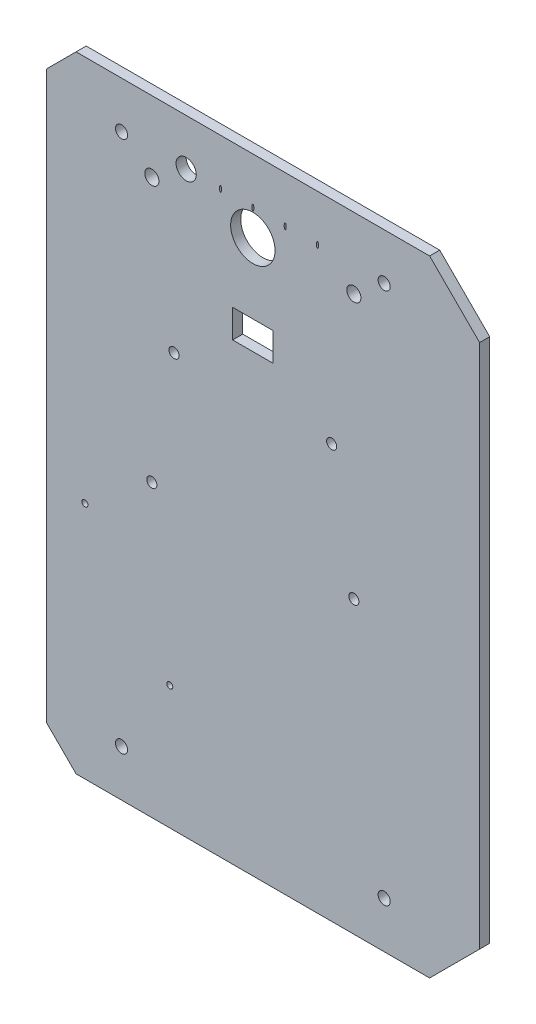
ISO-10303-21;
HEADER;
FILE_DESCRIPTION(('STEP AP214'),'2;1');
FILE_NAME('part.step','',(''),(''),'','','');
FILE_SCHEMA(('AUTOMOTIVE_DESIGN { 1 0 10303 214 1 1 1 1 }'));
ENDSEC;
DATA;
#1=APPLICATION_CONTEXT('core data for automotive mechanical design processes');
#2=APPLICATION_PROTOCOL_DEFINITION('international standard','automotive_design',2000,#1);
#3=PRODUCT_CONTEXT('',#1,'mechanical');
#4=PRODUCT('Part','Part','',(#3));
#5=PRODUCT_RELATED_PRODUCT_CATEGORY('part','',(#4));
#6=PRODUCT_DEFINITION_FORMATION('','',#4);
#7=PRODUCT_DEFINITION_CONTEXT('part definition',#1,'design');
#8=PRODUCT_DEFINITION('design','',#6,#7);
#9=PRODUCT_DEFINITION_SHAPE('','',#8);
#10=(LENGTH_UNIT() NAMED_UNIT(*) SI_UNIT(.MILLI.,.METRE.));
#11=(NAMED_UNIT(*) PLANE_ANGLE_UNIT() SI_UNIT($,.RADIAN.));
#12=(NAMED_UNIT(*) SI_UNIT($,.STERADIAN.) SOLID_ANGLE_UNIT());
#13=UNCERTAINTY_MEASURE_WITH_UNIT(LENGTH_MEASURE(1.E-05),#10,'distance_accuracy_value','');
#14=(GEOMETRIC_REPRESENTATION_CONTEXT(3) GLOBAL_UNCERTAINTY_ASSIGNED_CONTEXT((#13)) GLOBAL_UNIT_ASSIGNED_CONTEXT((#10,
#11,#12)) REPRESENTATION_CONTEXT('',''));
#15=CARTESIAN_POINT('',(0.,0.,0.));
#16=DIRECTION('',(0.,0.,1.));
#17=DIRECTION('',(1.,0.,0.));
#18=AXIS2_PLACEMENT_3D('',#15,#16,#17);
#19=CARTESIAN_POINT('',(24.7487373415291,24.7487373415292,5.));
#20=DIRECTION('',(-0.707106781186548,0.707106781186547,0.));
#21=DIRECTION('',(-0.707106781186547,-0.707106781186548,0.));
#22=AXIS2_PLACEMENT_3D('',#19,#20,#21);
#23=PLANE('',#22);
#24=DIRECTION('',(0.707106781186547,0.707106781186548,0.));
#25=VECTOR('',#24,1.);
#26=CARTESIAN_POINT('',(24.7487373415291,24.7487373415292,0.));
#27=LINE('',#26,#25);
#28=CARTESIAN_POINT('',(0.,0.,0.));
#29=VERTEX_POINT('',#28);
#30=CARTESIAN_POINT('',(24.7487373415291,24.7487373415292,0.));
#31=VERTEX_POINT('',#30);
#32=EDGE_CURVE('E148',#29,#31,#27,.T.);
#33=ORIENTED_EDGE('',*,*,#32,.T.);
#34=DIRECTION('',(0.,0.,-1.));
#35=VECTOR('',#34,1.);
#36=CARTESIAN_POINT('',(24.7487373415291,24.7487373415292,5.));
#37=LINE('',#36,#35);
#38=CARTESIAN_POINT('',(24.7487373415291,24.7487373415292,5.));
#39=VERTEX_POINT('',#38);
#40=EDGE_CURVE('E178',#39,#31,#37,.T.);
#41=ORIENTED_EDGE('',*,*,#40,.F.);
#42=DIRECTION('',(0.707106781186547,0.707106781186548,0.));
#43=VECTOR('',#42,1.);
#44=CARTESIAN_POINT('',(24.7487373415291,24.7487373415292,5.));
#45=LINE('',#44,#43);
#46=CARTESIAN_POINT('',(0.,0.,5.));
#47=VERTEX_POINT('',#46);
#48=EDGE_CURVE('E165',#47,#39,#45,.T.);
#49=ORIENTED_EDGE('',*,*,#48,.F.);
#50=DIRECTION('',(0.,0.,-1.));
#51=VECTOR('',#50,1.);
#52=CARTESIAN_POINT('',(0.,0.,5.));
#53=LINE('',#52,#51);
#54=EDGE_CURVE('E142',#47,#29,#53,.T.);
#55=ORIENTED_EDGE('',*,*,#54,.T.);
#56=EDGE_LOOP('',(#33,#41,#49,#55));
#57=FACE_BOUND('',#56,.T.);
#58=ADVANCED_FACE('F32',(#57),#23,.F.);
#59=CARTESIAN_POINT('',(24.7487373415292,284.748737341529,5.));
#60=DIRECTION('',(-1.,0.,0.));
#61=DIRECTION('',(0.,-1.,0.));
#62=AXIS2_PLACEMENT_3D('',#59,#60,#61);
#63=PLANE('',#62);
#64=DIRECTION('',(0.,1.,0.));
#65=VECTOR('',#64,1.);
#66=CARTESIAN_POINT('',(24.7487373415292,284.748737341529,0.));
#67=LINE('',#66,#65);
#68=CARTESIAN_POINT('',(24.7487373415292,284.748737341529,0.));
#69=VERTEX_POINT('',#68);
#70=EDGE_CURVE('E151',#31,#69,#67,.T.);
#71=ORIENTED_EDGE('',*,*,#70,.T.);
#72=DIRECTION('',(0.,0.,-1.));
#73=VECTOR('',#72,1.);
#74=CARTESIAN_POINT('',(24.7487373415292,284.748737341529,5.));
#75=LINE('',#74,#73);
#76=CARTESIAN_POINT('',(24.7487373415292,284.748737341529,5.));
#77=VERTEX_POINT('',#76);
#78=EDGE_CURVE('E175',#77,#69,#75,.T.);
#79=ORIENTED_EDGE('',*,*,#78,.F.);
#80=DIRECTION('',(0.,1.,0.));
#81=VECTOR('',#80,1.);
#82=CARTESIAN_POINT('',(24.7487373415292,284.748737341529,5.));
#83=LINE('',#82,#81);
#84=EDGE_CURVE('E409',#39,#77,#83,.T.);
#85=ORIENTED_EDGE('',*,*,#84,.F.);
#86=ORIENTED_EDGE('',*,*,#40,.T.);
#87=EDGE_LOOP('',(#71,#79,#85,#86));
#88=FACE_BOUND('',#87,.T.);
#89=ADVANCED_FACE('F290',(#88),#63,.F.);
#90=CARTESIAN_POINT('',(0.,309.497474683058,5.));
#91=DIRECTION('',(-0.707106781186547,-0.707106781186548,0.));
#92=DIRECTION('',(0.707106781186548,-0.707106781186547,0.));
#93=AXIS2_PLACEMENT_3D('',#90,#91,#92);
#94=PLANE('',#93);
#95=DIRECTION('',(-0.707106781186548,0.707106781186547,0.));
#96=VECTOR('',#95,1.);
#97=CARTESIAN_POINT('',(0.,309.497474683058,0.));
#98=LINE('',#97,#96);
#99=CARTESIAN_POINT('',(0.,309.497474683058,0.));
#100=VERTEX_POINT('',#99);
#101=EDGE_CURVE('E154',#69,#100,#98,.T.);
#102=ORIENTED_EDGE('',*,*,#101,.T.);
#103=DIRECTION('',(0.,0.,-1.));
#104=VECTOR('',#103,1.);
#105=CARTESIAN_POINT('',(0.,309.497474683058,5.));
#106=LINE('',#105,#104);
#107=CARTESIAN_POINT('',(0.,309.497474683058,5.));
#108=VERTEX_POINT('',#107);
#109=EDGE_CURVE('E172',#108,#100,#106,.T.);
#110=ORIENTED_EDGE('',*,*,#109,.F.);
#111=DIRECTION('',(-0.707106781186548,0.707106781186547,0.));
#112=VECTOR('',#111,1.);
#113=CARTESIAN_POINT('',(0.,309.497474683058,5.));
#114=LINE('',#113,#112);
#115=EDGE_CURVE('E305',#77,#108,#114,.T.);
#116=ORIENTED_EDGE('',*,*,#115,.F.);
#117=ORIENTED_EDGE('',*,*,#78,.T.);
#118=EDGE_LOOP('',(#102,#110,#116,#117));
#119=FACE_BOUND('',#118,.T.);
#120=ADVANCED_FACE('F287',(#119),#94,.F.);
#121=CARTESIAN_POINT('',(-175.,309.497474683058,5.));
#122=DIRECTION('',(0.,-1.,0.));
#123=DIRECTION('',(0.,0.,-1.));
#124=AXIS2_PLACEMENT_3D('',#121,#122,#123);
#125=PLANE('',#124);
#126=DIRECTION('',(-1.,0.,0.));
#127=VECTOR('',#126,1.);
#128=CARTESIAN_POINT('',(-175.,309.497474683058,0.));
#129=LINE('',#128,#127);
#130=CARTESIAN_POINT('',(-175.,309.497474683058,0.));
#131=VERTEX_POINT('',#130);
#132=EDGE_CURVE('E156',#100,#131,#129,.T.);
#133=ORIENTED_EDGE('',*,*,#132,.T.);
#134=DIRECTION('',(0.,0.,-1.));
#135=VECTOR('',#134,1.);
#136=CARTESIAN_POINT('',(-175.,309.497474683058,5.));
#137=LINE('',#136,#135);
#138=CARTESIAN_POINT('',(-175.,309.497474683058,5.));
#139=VERTEX_POINT('',#138);
#140=EDGE_CURVE('E169',#139,#131,#137,.T.);
#141=ORIENTED_EDGE('',*,*,#140,.F.);
#142=DIRECTION('',(-1.,0.,0.));
#143=VECTOR('',#142,1.);
#144=CARTESIAN_POINT('',(-175.,309.497474683058,5.));
#145=LINE('',#144,#143);
#146=EDGE_CURVE('E144',#108,#139,#145,.T.);
#147=ORIENTED_EDGE('',*,*,#146,.F.);
#148=ORIENTED_EDGE('',*,*,#109,.T.);
#149=EDGE_LOOP('',(#133,#141,#147,#148));
#150=FACE_BOUND('',#149,.T.);
#151=ADVANCED_FACE('F283',(#150),#125,.F.);
#152=CARTESIAN_POINT('',(-199.748737341529,284.748737341529,5.));
#153=DIRECTION('',(0.707106781186548,-0.707106781186548,0.));
#154=DIRECTION('',(0.707106781186548,0.707106781186548,0.));
#155=AXIS2_PLACEMENT_3D('',#152,#153,#154);
#156=PLANE('',#155);
#157=DIRECTION('',(-0.707106781186547,-0.707106781186547,0.));
#158=VECTOR('',#157,1.);
#159=CARTESIAN_POINT('',(-199.748737341529,284.748737341529,0.));
#160=LINE('',#159,#158);
#161=CARTESIAN_POINT('',(-189.748737341529,294.748737341529,0.));
#162=VERTEX_POINT('',#161);
#163=EDGE_CURVE('E158',#131,#162,#160,.T.);
#164=ORIENTED_EDGE('',*,*,#163,.T.);
#165=DIRECTION('',(0.,0.,1.));
#166=VECTOR('',#165,1.);
#167=CARTESIAN_POINT('',(-189.748737341529,294.748737341529,5.));
#168=LINE('',#167,#166);
#169=CARTESIAN_POINT('',(-189.748737341529,294.748737341529,5.));
#170=VERTEX_POINT('',#169);
#171=EDGE_CURVE('E45',#162,#170,#168,.T.);
#172=ORIENTED_EDGE('',*,*,#171,.T.);
#173=DIRECTION('',(-0.707106781186547,-0.707106781186547,0.));
#174=VECTOR('',#173,1.);
#175=CARTESIAN_POINT('',(-199.748737341529,284.748737341529,5.));
#176=LINE('',#175,#174);
#177=EDGE_CURVE('E133',#139,#170,#176,.T.);
#178=ORIENTED_EDGE('',*,*,#177,.F.);
#179=ORIENTED_EDGE('',*,*,#140,.T.);
#180=EDGE_LOOP('',(#164,#172,#178,#179));
#181=FACE_BOUND('',#180,.T.);
#182=ADVANCED_FACE('F280',(#181),#156,.F.);
#183=CARTESIAN_POINT('',(-175.,0.,5.));
#184=DIRECTION('',(0.707106781186547,0.707106781186548,0.));
#185=DIRECTION('',(-0.707106781186548,0.707106781186547,0.));
#186=AXIS2_PLACEMENT_3D('',#183,#184,#185);
#187=PLANE('',#186);
#188=DIRECTION('',(0.707106781186548,-0.707106781186547,0.));
#189=VECTOR('',#188,1.);
#190=CARTESIAN_POINT('',(-175.,0.,5.));
#191=LINE('',#190,#189);
#192=CARTESIAN_POINT('',(-189.748737341529,14.7487373415291,5.));
#193=VERTEX_POINT('',#192);
#194=CARTESIAN_POINT('',(-175.,0.,5.));
#195=VERTEX_POINT('',#194);
#196=EDGE_CURVE('E130',#193,#195,#191,.T.);
#197=ORIENTED_EDGE('',*,*,#196,.F.);
#198=DIRECTION('',(0.,0.,-1.));
#199=VECTOR('',#198,1.);
#200=CARTESIAN_POINT('',(-189.748737341529,14.7487373415291,5.));
#201=LINE('',#200,#199);
#202=CARTESIAN_POINT('',(-189.748737341529,14.7487373415291,0.));
#203=VERTEX_POINT('',#202);
#204=EDGE_CURVE('E118',#193,#203,#201,.T.);
#205=ORIENTED_EDGE('',*,*,#204,.T.);
#206=DIRECTION('',(0.707106781186548,-0.707106781186547,0.));
#207=VECTOR('',#206,1.);
#208=CARTESIAN_POINT('',(-175.,0.,0.));
#209=LINE('',#208,#207);
#210=CARTESIAN_POINT('',(-175.,0.,0.));
#211=VERTEX_POINT('',#210);
#212=EDGE_CURVE('E161',#203,#211,#209,.T.);
#213=ORIENTED_EDGE('',*,*,#212,.T.);
#214=DIRECTION('',(0.,0.,-1.));
#215=VECTOR('',#214,1.);
#216=CARTESIAN_POINT('',(-175.,0.,5.));
#217=LINE('',#216,#215);
#218=EDGE_CURVE('E138',#195,#211,#217,.T.);
#219=ORIENTED_EDGE('',*,*,#218,.F.);
#220=EDGE_LOOP('',(#197,#205,#213,#219));
#221=FACE_BOUND('',#220,.T.);
#222=ADVANCED_FACE('F136',(#221),#187,.F.);
#223=CARTESIAN_POINT('',(0.,0.,5.));
#224=DIRECTION('',(0.,1.,0.));
#225=DIRECTION('',(0.,0.,1.));
#226=AXIS2_PLACEMENT_3D('',#223,#224,#225);
#227=PLANE('',#226);
#228=DIRECTION('',(1.,0.,0.));
#229=VECTOR('',#228,1.);
#230=CARTESIAN_POINT('',(0.,0.,0.));
#231=LINE('',#230,#229);
#232=EDGE_CURVE('E163',#211,#29,#231,.T.);
#233=ORIENTED_EDGE('',*,*,#232,.T.);
#234=ORIENTED_EDGE('',*,*,#54,.F.);
#235=DIRECTION('',(1.,0.,0.));
#236=VECTOR('',#235,1.);
#237=CARTESIAN_POINT('',(0.,0.,5.));
#238=LINE('',#237,#236);
#239=EDGE_CURVE('E140',#195,#47,#238,.T.);
#240=ORIENTED_EDGE('',*,*,#239,.F.);
#241=ORIENTED_EDGE('',*,*,#218,.T.);
#242=EDGE_LOOP('',(#233,#234,#240,#241));
#243=FACE_BOUND('',#242,.T.);
#244=ADVANCED_FACE('F270',(#243),#227,.F.);
#245=CARTESIAN_POINT('',(0.,0.,5.));
#246=DIRECTION('',(0.,0.,-1.));
#247=DIRECTION('',(-1.,0.,0.));
#248=AXIS2_PLACEMENT_3D('',#245,#246,#247);
#249=PLANE('',#248);
#250=CARTESIAN_POINT('',(-128.614939474584,61.1523718393633,5.));
#251=DIRECTION('',(0.,0.,1.));
#252=DIRECTION('',(1.,0.,0.));
#253=AXIS2_PLACEMENT_3D('',#250,#251,#252);
#254=CIRCLE('',#253,1.49999999999997);
#255=CARTESIAN_POINT('',(-127.114939474584,61.1523718393633,5.));
#256=VERTEX_POINT('',#255);
#257=EDGE_CURVE('E507',#256,#256,#254,.T.);
#258=ORIENTED_EDGE('',*,*,#257,.F.);
#259=EDGE_LOOP('',(#258));
#260=FACE_BOUND('',#259,.T.);
#261=CARTESIAN_POINT('',(-170.614939474584,118.152371839363,5.));
#262=DIRECTION('',(0.,0.,1.));
#263=DIRECTION('',(1.,0.,0.));
#264=AXIS2_PLACEMENT_3D('',#261,#262,#263);
#265=CIRCLE('',#264,1.5);
#266=CARTESIAN_POINT('',(-169.114939474584,118.152371839363,5.));
#267=VERTEX_POINT('',#266);
#268=EDGE_CURVE('E134',#267,#267,#265,.T.);
#269=ORIENTED_EDGE('',*,*,#268,.F.);
#270=EDGE_LOOP('',(#269));
#271=FACE_BOUND('',#270,.T.);
#272=CARTESIAN_POINT('',(-137.5,143.748737341529,5.));
#273=DIRECTION('',(0.,0.,1.));
#274=DIRECTION('',(1.,0.,0.));
#275=AXIS2_PLACEMENT_3D('',#272,#273,#274);
#276=CIRCLE('',#275,2.5);
#277=CARTESIAN_POINT('',(-135.,143.748737341529,5.));
#278=VERTEX_POINT('',#277);
#279=EDGE_CURVE('E320',#278,#278,#276,.T.);
#280=ORIENTED_EDGE('',*,*,#279,.F.);
#281=EDGE_LOOP('',(#280));
#282=FACE_BOUND('',#281,.T.);
#283=CARTESIAN_POINT('',(-22.5012626584709,286.497474683058,5.));
#284=DIRECTION('',(0.,0.,1.));
#285=DIRECTION('',(1.,0.,0.));
#286=AXIS2_PLACEMENT_3D('',#283,#284,#285);
#287=CIRCLE('',#286,3.00000000000001);
#288=CARTESIAN_POINT('',(-19.5012626584709,286.497474683058,5.));
#289=VERTEX_POINT('',#288);
#290=EDGE_CURVE('E323',#289,#289,#287,.T.);
#291=ORIENTED_EDGE('',*,*,#290,.F.);
#292=EDGE_LOOP('',(#291));
#293=FACE_BOUND('',#292,.T.);
#294=CARTESIAN_POINT('',(-22.5012626584708,23.,5.));
#295=DIRECTION('',(0.,0.,1.));
#296=DIRECTION('',(-1.,0.,0.));
#297=AXIS2_PLACEMENT_3D('',#294,#295,#296);
#298=CIRCLE('',#297,2.99999999999999);
#299=CARTESIAN_POINT('',(-25.5012626584708,23.,5.));
#300=VERTEX_POINT('',#299);
#301=EDGE_CURVE('E326',#300,#300,#298,.T.);
#302=ORIENTED_EDGE('',*,*,#301,.F.);
#303=EDGE_LOOP('',(#302));
#304=FACE_BOUND('',#303,.T.);
#305=CARTESIAN_POINT('',(-152.498737341529,286.497474683058,5.));
#306=DIRECTION('',(0.,0.,1.));
#307=DIRECTION('',(-1.,0.,0.));
#308=AXIS2_PLACEMENT_3D('',#305,#306,#307);
#309=CIRCLE('',#308,2.99999999999999);
#310=CARTESIAN_POINT('',(-155.498737341529,286.497474683058,5.));
#311=VERTEX_POINT('',#310);
#312=EDGE_CURVE('E329',#311,#311,#309,.T.);
#313=ORIENTED_EDGE('',*,*,#312,.F.);
#314=EDGE_LOOP('',(#313));
#315=FACE_BOUND('',#314,.T.);
#316=CARTESIAN_POINT('',(-48.5,204.748737341529,5.));
#317=DIRECTION('',(0.,0.,1.));
#318=DIRECTION('',(-1.,0.,0.));
#319=AXIS2_PLACEMENT_3D('',#316,#317,#318);
#320=CIRCLE('',#319,2.5);
#321=CARTESIAN_POINT('',(-51.,204.748737341529,5.));
#322=VERTEX_POINT('',#321);
#323=EDGE_CURVE('E311',#322,#322,#320,.T.);
#324=ORIENTED_EDGE('',*,*,#323,.F.);
#325=EDGE_LOOP('',(#324));
#326=FACE_BOUND('',#325,.T.);
#327=CARTESIAN_POINT('',(-37.5,143.748737341529,5.));
#328=DIRECTION('',(0.,0.,1.));
#329=DIRECTION('',(-1.,0.,0.));
#330=AXIS2_PLACEMENT_3D('',#327,#328,#329);
#331=CIRCLE('',#330,2.5);
#332=CARTESIAN_POINT('',(-40.,143.748737341529,5.));
#333=VERTEX_POINT('',#332);
#334=EDGE_CURVE('E314',#333,#333,#331,.T.);
#335=ORIENTED_EDGE('',*,*,#334,.F.);
#336=EDGE_LOOP('',(#335));
#337=FACE_BOUND('',#336,.T.);
#338=CARTESIAN_POINT('',(-126.5,204.748737341529,5.));
#339=DIRECTION('',(0.,0.,1.));
#340=DIRECTION('',(1.,0.,0.));
#341=AXIS2_PLACEMENT_3D('',#338,#339,#340);
#342=CIRCLE('',#341,2.5);
#343=CARTESIAN_POINT('',(-124.,204.748737341529,5.));
#344=VERTEX_POINT('',#343);
#345=EDGE_CURVE('E317',#344,#344,#342,.T.);
#346=ORIENTED_EDGE('',*,*,#345,.F.);
#347=EDGE_LOOP('',(#346));
#348=FACE_BOUND('',#347,.T.);
#349=CARTESIAN_POINT('',(-152.498737341529,23.,5.));
#350=DIRECTION('',(0.,0.,1.));
#351=DIRECTION('',(1.,0.,0.));
#352=AXIS2_PLACEMENT_3D('',#349,#350,#351);
#353=CIRCLE('',#352,2.99999999999999);
#354=CARTESIAN_POINT('',(-149.498737341529,23.,5.));
#355=VERTEX_POINT('',#354);
#356=EDGE_CURVE('E218',#355,#355,#353,.T.);
#357=ORIENTED_EDGE('',*,*,#356,.F.);
#358=EDGE_LOOP('',(#357));
#359=FACE_BOUND('',#358,.T.);
#360=CARTESIAN_POINT('',(-55.5,286.497474683058,5.));
#361=DIRECTION('',(0.,0.,1.));
#362=DIRECTION('',(0.,-1.,0.));
#363=AXIS2_PLACEMENT_3D('',#360,#361,#362);
#364=ELLIPSE('',#363,1.5,0.5);
#365=CARTESIAN_POINT('',(-55.5,284.997474683058,5.));
#366=VERTEX_POINT('',#365);
#367=EDGE_CURVE('E237',#366,#366,#364,.T.);
#368=ORIENTED_EDGE('',*,*,#367,.F.);
#369=EDGE_LOOP('',(#368));
#370=FACE_BOUND('',#369,.T.);
#371=CARTESIAN_POINT('',(-71.5,286.497474683058,5.));
#372=DIRECTION('',(0.,0.,1.));
#373=DIRECTION('',(0.,-1.,0.));
#374=AXIS2_PLACEMENT_3D('',#371,#372,#373);
#375=ELLIPSE('',#374,1.5,0.5);
#376=CARTESIAN_POINT('',(-71.5,284.997474683058,5.));
#377=VERTEX_POINT('',#376);
#378=EDGE_CURVE('E241',#377,#377,#375,.T.);
#379=ORIENTED_EDGE('',*,*,#378,.F.);
#380=EDGE_LOOP('',(#379));
#381=FACE_BOUND('',#380,.T.);
#382=CARTESIAN_POINT('',(-87.5,286.497474683058,5.));
#383=DIRECTION('',(0.,0.,1.));
#384=DIRECTION('',(0.,-1.,0.));
#385=AXIS2_PLACEMENT_3D('',#382,#383,#384);
#386=ELLIPSE('',#385,1.5,0.5);
#387=CARTESIAN_POINT('',(-87.5,284.997474683058,5.));
#388=VERTEX_POINT('',#387);
#389=EDGE_CURVE('E246',#388,#388,#386,.T.);
#390=ORIENTED_EDGE('',*,*,#389,.F.);
#391=EDGE_LOOP('',(#390));
#392=FACE_BOUND('',#391,.T.);
#393=CARTESIAN_POINT('',(-87.5,273.497474683058,5.));
#394=DIRECTION('',(0.,0.,1.));
#395=DIRECTION('',(1.,0.,0.));
#396=AXIS2_PLACEMENT_3D('',#393,#394,#395);
#397=CIRCLE('',#396,11.);
#398=CARTESIAN_POINT('',(-76.5,273.497474683058,5.));
#399=VERTEX_POINT('',#398);
#400=EDGE_CURVE('E358',#399,#399,#397,.T.);
#401=ORIENTED_EDGE('',*,*,#400,.F.);
#402=EDGE_LOOP('',(#401));
#403=FACE_BOUND('',#402,.T.);
#404=CARTESIAN_POINT('',(-37.5,274.497474683058,5.));
#405=DIRECTION('',(0.,0.,1.));
#406=DIRECTION('',(1.,0.,0.));
#407=AXIS2_PLACEMENT_3D('',#404,#405,#406);
#408=CIRCLE('',#407,3.50000000000001);
#409=CARTESIAN_POINT('',(-34.,274.497474683058,5.));
#410=VERTEX_POINT('',#409);
#411=EDGE_CURVE('E339',#410,#410,#408,.T.);
#412=ORIENTED_EDGE('',*,*,#411,.F.);
#413=EDGE_LOOP('',(#412));
#414=FACE_BOUND('',#413,.T.);
#415=CARTESIAN_POINT('',(-137.5,274.497474683058,5.));
#416=DIRECTION('',(0.,0.,1.));
#417=DIRECTION('',(1.,0.,0.));
#418=AXIS2_PLACEMENT_3D('',#415,#416,#417);
#419=CIRCLE('',#418,3.50000000000002);
#420=CARTESIAN_POINT('',(-134.,274.497474683058,5.));
#421=VERTEX_POINT('',#420);
#422=EDGE_CURVE('E336',#421,#421,#419,.T.);
#423=ORIENTED_EDGE('',*,*,#422,.F.);
#424=EDGE_LOOP('',(#423));
#425=FACE_BOUND('',#424,.T.);
#426=DIRECTION('',(1.,0.,0.));
#427=VECTOR('',#426,1.);
#428=CARTESIAN_POINT('',(-97.5,224.748737341529,5.));
#429=LINE('',#428,#427);
#430=CARTESIAN_POINT('',(-97.5,224.748737341529,5.));
#431=VERTEX_POINT('',#430);
#432=CARTESIAN_POINT('',(-77.5,224.748737341529,5.));
#433=VERTEX_POINT('',#432);
#434=EDGE_CURVE('E342',#431,#433,#429,.T.);
#435=ORIENTED_EDGE('',*,*,#434,.F.);
#436=DIRECTION('',(0.,-1.,0.));
#437=VECTOR('',#436,1.);
#438=CARTESIAN_POINT('',(-97.5,238.748737341529,5.));
#439=LINE('',#438,#437);
#440=CARTESIAN_POINT('',(-97.5,238.748737341529,5.));
#441=VERTEX_POINT('',#440);
#442=EDGE_CURVE('E53',#441,#431,#439,.T.);
#443=ORIENTED_EDGE('',*,*,#442,.F.);
#444=DIRECTION('',(-1.,0.,0.));
#445=VECTOR('',#444,1.);
#446=CARTESIAN_POINT('',(-97.5,238.748737341529,5.));
#447=LINE('',#446,#445);
#448=CARTESIAN_POINT('',(-77.5,238.748737341529,5.));
#449=VERTEX_POINT('',#448);
#450=EDGE_CURVE('E348',#449,#441,#447,.T.);
#451=ORIENTED_EDGE('',*,*,#450,.F.);
#452=DIRECTION('',(0.,1.,0.));
#453=VECTOR('',#452,1.);
#454=CARTESIAN_POINT('',(-77.5,238.748737341529,5.));
#455=LINE('',#454,#453);
#456=EDGE_CURVE('E345',#433,#449,#455,.T.);
#457=ORIENTED_EDGE('',*,*,#456,.F.);
#458=EDGE_LOOP('',(#435,#443,#451,#457));
#459=FACE_BOUND('',#458,.T.);
#460=CARTESIAN_POINT('',(-103.5,286.497474683058,5.));
#461=DIRECTION('',(0.,0.,1.));
#462=DIRECTION('',(0.,-1.,0.));
#463=AXIS2_PLACEMENT_3D('',#460,#461,#462);
#464=ELLIPSE('',#463,1.5,0.5);
#465=CARTESIAN_POINT('',(-103.5,284.997474683058,5.));
#466=VERTEX_POINT('',#465);
#467=EDGE_CURVE('E189',#466,#466,#464,.T.);
#468=ORIENTED_EDGE('',*,*,#467,.F.);
#469=EDGE_LOOP('',(#468));
#470=FACE_BOUND('',#469,.T.);
#471=CARTESIAN_POINT('',(-120.5,286.497474683058,5.));
#472=DIRECTION('',(0.,0.,1.));
#473=DIRECTION('',(1.,0.,0.));
#474=AXIS2_PLACEMENT_3D('',#471,#472,#473);
#475=CIRCLE('',#474,5.00000000000001);
#476=CARTESIAN_POINT('',(-115.5,286.497474683058,5.));
#477=VERTEX_POINT('',#476);
#478=EDGE_CURVE('E184',#477,#477,#475,.T.);
#479=ORIENTED_EDGE('',*,*,#478,.F.);
#480=EDGE_LOOP('',(#479));
#481=FACE_BOUND('',#480,.T.);
#482=ORIENTED_EDGE('',*,*,#177,.T.);
#483=DIRECTION('',(0.,1.,0.));
#484=VECTOR('',#483,1.);
#485=CARTESIAN_POINT('',(-189.748737341529,134.748737341529,5.));
#486=LINE('',#485,#484);
#487=EDGE_CURVE('E121',#193,#170,#486,.T.);
#488=ORIENTED_EDGE('',*,*,#487,.F.);
#489=ORIENTED_EDGE('',*,*,#196,.T.);
#490=ORIENTED_EDGE('',*,*,#239,.T.);
#491=ORIENTED_EDGE('',*,*,#48,.T.);
#492=ORIENTED_EDGE('',*,*,#84,.T.);
#493=ORIENTED_EDGE('',*,*,#115,.T.);
#494=ORIENTED_EDGE('',*,*,#146,.T.);
#495=EDGE_LOOP('',(#482,#488,#489,#490,#491,#492,#493,#494));
#496=FACE_BOUND('',#495,.T.);
#497=ADVANCED_FACE('F129',(#260,#271,#282,#293,#304,#315,#326,#337,#348,#359,#370,#381,#392,
#403,#414,#425,#459,#470,#481,#496),#249,.F.);
#498=CARTESIAN_POINT('',(0.,0.,0.));
#499=DIRECTION('',(0.,0.,-1.));
#500=DIRECTION('',(-1.,0.,0.));
#501=AXIS2_PLACEMENT_3D('',#498,#499,#500);
#502=PLANE('',#501);
#503=CARTESIAN_POINT('',(-128.614939474584,61.1523718393633,0.));
#504=DIRECTION('',(0.,0.,1.));
#505=DIRECTION('',(1.,0.,0.));
#506=AXIS2_PLACEMENT_3D('',#503,#504,#505);
#507=CIRCLE('',#506,1.49999999999997);
#508=CARTESIAN_POINT('',(-127.114939474584,61.1523718393633,0.));
#509=VERTEX_POINT('',#508);
#510=EDGE_CURVE('E125',#509,#509,#507,.T.);
#511=ORIENTED_EDGE('',*,*,#510,.T.);
#512=EDGE_LOOP('',(#511));
#513=FACE_BOUND('',#512,.T.);
#514=CARTESIAN_POINT('',(-170.614939474584,118.152371839363,0.));
#515=DIRECTION('',(0.,0.,1.));
#516=DIRECTION('',(1.,0.,0.));
#517=AXIS2_PLACEMENT_3D('',#514,#515,#516);
#518=CIRCLE('',#517,1.5);
#519=CARTESIAN_POINT('',(-169.114939474584,118.152371839363,0.));
#520=VERTEX_POINT('',#519);
#521=EDGE_CURVE('E508',#520,#520,#518,.T.);
#522=ORIENTED_EDGE('',*,*,#521,.T.);
#523=EDGE_LOOP('',(#522));
#524=FACE_BOUND('',#523,.T.);
#525=DIRECTION('',(0.,-1.,0.));
#526=VECTOR('',#525,1.);
#527=CARTESIAN_POINT('',(-189.748737341529,0.,0.));
#528=LINE('',#527,#526);
#529=EDGE_CURVE('E11',#162,#203,#528,.T.);
#530=ORIENTED_EDGE('',*,*,#529,.F.);
#531=ORIENTED_EDGE('',*,*,#163,.F.);
#532=ORIENTED_EDGE('',*,*,#132,.F.);
#533=ORIENTED_EDGE('',*,*,#101,.F.);
#534=ORIENTED_EDGE('',*,*,#70,.F.);
#535=ORIENTED_EDGE('',*,*,#32,.F.);
#536=ORIENTED_EDGE('',*,*,#232,.F.);
#537=ORIENTED_EDGE('',*,*,#212,.F.);
#538=EDGE_LOOP('',(#530,#531,#532,#533,#534,#535,#536,#537));
#539=FACE_BOUND('',#538,.T.);
#540=CARTESIAN_POINT('',(-137.5,143.748737341529,0.));
#541=DIRECTION('',(0.,0.,-1.));
#542=DIRECTION('',(-1.,0.,0.));
#543=AXIS2_PLACEMENT_3D('',#540,#541,#542);
#544=CIRCLE('',#543,2.5);
#545=CARTESIAN_POINT('',(-140.,143.748737341529,0.));
#546=VERTEX_POINT('',#545);
#547=EDGE_CURVE('E235',#546,#546,#544,.T.);
#548=ORIENTED_EDGE('',*,*,#547,.F.);
#549=EDGE_LOOP('',(#548));
#550=FACE_BOUND('',#549,.T.);
#551=CARTESIAN_POINT('',(-22.5012626584709,286.497474683058,0.));
#552=DIRECTION('',(0.,0.,-1.));
#553=DIRECTION('',(-1.,0.,0.));
#554=AXIS2_PLACEMENT_3D('',#551,#552,#553);
#555=CIRCLE('',#554,3.00000000000001);
#556=CARTESIAN_POINT('',(-25.5012626584709,286.497474683058,0.));
#557=VERTEX_POINT('',#556);
#558=EDGE_CURVE('E233',#557,#557,#555,.T.);
#559=ORIENTED_EDGE('',*,*,#558,.F.);
#560=EDGE_LOOP('',(#559));
#561=FACE_BOUND('',#560,.T.);
#562=CARTESIAN_POINT('',(-22.5012626584708,23.,0.));
#563=DIRECTION('',(0.,0.,-1.));
#564=DIRECTION('',(-1.,0.,0.));
#565=AXIS2_PLACEMENT_3D('',#562,#563,#564);
#566=CIRCLE('',#565,2.99999999999999);
#567=CARTESIAN_POINT('',(-25.5012626584708,23.,0.));
#568=VERTEX_POINT('',#567);
#569=EDGE_CURVE('E230',#568,#568,#566,.T.);
#570=ORIENTED_EDGE('',*,*,#569,.F.);
#571=EDGE_LOOP('',(#570));
#572=FACE_BOUND('',#571,.T.);
#573=CARTESIAN_POINT('',(-152.498737341529,286.497474683058,0.));
#574=DIRECTION('',(0.,0.,-1.));
#575=DIRECTION('',(-1.,0.,0.));
#576=AXIS2_PLACEMENT_3D('',#573,#574,#575);
#577=CIRCLE('',#576,2.99999999999999);
#578=CARTESIAN_POINT('',(-155.498737341529,286.497474683058,0.));
#579=VERTEX_POINT('',#578);
#580=EDGE_CURVE('E227',#579,#579,#577,.T.);
#581=ORIENTED_EDGE('',*,*,#580,.F.);
#582=EDGE_LOOP('',(#581));
#583=FACE_BOUND('',#582,.T.);
#584=CARTESIAN_POINT('',(-48.5,204.748737341529,0.));
#585=DIRECTION('',(0.,0.,-1.));
#586=DIRECTION('',(-1.,0.,0.));
#587=AXIS2_PLACEMENT_3D('',#584,#585,#586);
#588=CIRCLE('',#587,2.5);
#589=CARTESIAN_POINT('',(-51.,204.748737341529,0.));
#590=VERTEX_POINT('',#589);
#591=EDGE_CURVE('E224',#590,#590,#588,.T.);
#592=ORIENTED_EDGE('',*,*,#591,.F.);
#593=EDGE_LOOP('',(#592));
#594=FACE_BOUND('',#593,.T.);
#595=CARTESIAN_POINT('',(-37.5,143.748737341529,0.));
#596=DIRECTION('',(0.,0.,-1.));
#597=DIRECTION('',(-1.,0.,0.));
#598=AXIS2_PLACEMENT_3D('',#595,#596,#597);
#599=CIRCLE('',#598,2.5);
#600=CARTESIAN_POINT('',(-40.,143.748737341529,0.));
#601=VERTEX_POINT('',#600);
#602=EDGE_CURVE('E221',#601,#601,#599,.T.);
#603=ORIENTED_EDGE('',*,*,#602,.F.);
#604=EDGE_LOOP('',(#603));
#605=FACE_BOUND('',#604,.T.);
#606=CARTESIAN_POINT('',(-126.5,204.748737341529,0.));
#607=DIRECTION('',(0.,0.,-1.));
#608=DIRECTION('',(-1.,0.,0.));
#609=AXIS2_PLACEMENT_3D('',#606,#607,#608);
#610=CIRCLE('',#609,2.5);
#611=CARTESIAN_POINT('',(-129.,204.748737341529,0.));
#612=VERTEX_POINT('',#611);
#613=EDGE_CURVE('E217',#612,#612,#610,.T.);
#614=ORIENTED_EDGE('',*,*,#613,.F.);
#615=EDGE_LOOP('',(#614));
#616=FACE_BOUND('',#615,.T.);
#617=CARTESIAN_POINT('',(-152.498737341529,23.,0.));
#618=DIRECTION('',(0.,0.,-1.));
#619=DIRECTION('',(-1.,0.,0.));
#620=AXIS2_PLACEMENT_3D('',#617,#618,#619);
#621=CIRCLE('',#620,2.99999999999999);
#622=CARTESIAN_POINT('',(-155.498737341529,23.,0.));
#623=VERTEX_POINT('',#622);
#624=EDGE_CURVE('E214',#623,#623,#621,.T.);
#625=ORIENTED_EDGE('',*,*,#624,.F.);
#626=EDGE_LOOP('',(#625));
#627=FACE_BOUND('',#626,.T.);
#628=CARTESIAN_POINT('',(-55.5,286.497474683058,0.));
#629=DIRECTION('',(0.,0.,1.));
#630=DIRECTION('',(0.,-1.,0.));
#631=AXIS2_PLACEMENT_3D('',#628,#629,#630);
#632=ELLIPSE('',#631,1.5,0.5);
#633=CARTESIAN_POINT('',(-55.5,284.997474683058,0.));
#634=VERTEX_POINT('',#633);
#635=EDGE_CURVE('E211',#634,#634,#632,.F.);
#636=ORIENTED_EDGE('',*,*,#635,.F.);
#637=EDGE_LOOP('',(#636));
#638=FACE_BOUND('',#637,.T.);
#639=CARTESIAN_POINT('',(-71.5,286.497474683058,0.));
#640=DIRECTION('',(0.,0.,1.));
#641=DIRECTION('',(0.,-1.,0.));
#642=AXIS2_PLACEMENT_3D('',#639,#640,#641);
#643=ELLIPSE('',#642,1.5,0.5);
#644=CARTESIAN_POINT('',(-71.5,284.997474683058,0.));
#645=VERTEX_POINT('',#644);
#646=EDGE_CURVE('E208',#645,#645,#643,.F.);
#647=ORIENTED_EDGE('',*,*,#646,.F.);
#648=EDGE_LOOP('',(#647));
#649=FACE_BOUND('',#648,.T.);
#650=CARTESIAN_POINT('',(-87.5,286.497474683058,0.));
#651=DIRECTION('',(0.,0.,1.));
#652=DIRECTION('',(0.,-1.,0.));
#653=AXIS2_PLACEMENT_3D('',#650,#651,#652);
#654=ELLIPSE('',#653,1.5,0.5);
#655=CARTESIAN_POINT('',(-87.5,284.997474683058,0.));
#656=VERTEX_POINT('',#655);
#657=EDGE_CURVE('E205',#656,#656,#654,.F.);
#658=ORIENTED_EDGE('',*,*,#657,.F.);
#659=EDGE_LOOP('',(#658));
#660=FACE_BOUND('',#659,.T.);
#661=CARTESIAN_POINT('',(-87.5,273.497474683058,0.));
#662=DIRECTION('',(0.,0.,-1.));
#663=DIRECTION('',(-1.,0.,0.));
#664=AXIS2_PLACEMENT_3D('',#661,#662,#663);
#665=CIRCLE('',#664,11.);
#666=CARTESIAN_POINT('',(-98.5,273.497474683058,0.));
#667=VERTEX_POINT('',#666);
#668=EDGE_CURVE('E202',#667,#667,#665,.T.);
#669=ORIENTED_EDGE('',*,*,#668,.F.);
#670=EDGE_LOOP('',(#669));
#671=FACE_BOUND('',#670,.T.);
#672=CARTESIAN_POINT('',(-37.5,274.497474683058,0.));
#673=DIRECTION('',(0.,0.,-1.));
#674=DIRECTION('',(-1.,0.,0.));
#675=AXIS2_PLACEMENT_3D('',#672,#673,#674);
#676=CIRCLE('',#675,3.50000000000001);
#677=CARTESIAN_POINT('',(-41.,274.497474683058,0.));
#678=VERTEX_POINT('',#677);
#679=EDGE_CURVE('E199',#678,#678,#676,.T.);
#680=ORIENTED_EDGE('',*,*,#679,.F.);
#681=EDGE_LOOP('',(#680));
#682=FACE_BOUND('',#681,.T.);
#683=CARTESIAN_POINT('',(-137.5,274.497474683058,0.));
#684=DIRECTION('',(0.,0.,-1.));
#685=DIRECTION('',(-1.,0.,0.));
#686=AXIS2_PLACEMENT_3D('',#683,#684,#685);
#687=CIRCLE('',#686,3.50000000000002);
#688=CARTESIAN_POINT('',(-141.,274.497474683058,0.));
#689=VERTEX_POINT('',#688);
#690=EDGE_CURVE('E188',#689,#689,#687,.T.);
#691=ORIENTED_EDGE('',*,*,#690,.F.);
#692=EDGE_LOOP('',(#691));
#693=FACE_BOUND('',#692,.T.);
#694=DIRECTION('',(0.,1.,0.));
#695=VECTOR('',#694,1.);
#696=CARTESIAN_POINT('',(-97.5000000000003,0.,0.));
#697=LINE('',#696,#695);
#698=CARTESIAN_POINT('',(-97.5,224.748737341529,0.));
#699=VERTEX_POINT('',#698);
#700=CARTESIAN_POINT('',(-97.5,238.748737341529,0.));
#701=VERTEX_POINT('',#700);
#702=EDGE_CURVE('E39',#699,#701,#697,.T.);
#703=ORIENTED_EDGE('',*,*,#702,.F.);
#704=DIRECTION('',(-1.,0.,0.));
#705=VECTOR('',#704,1.);
#706=CARTESIAN_POINT('',(0.,224.748737341529,0.));
#707=LINE('',#706,#705);
#708=CARTESIAN_POINT('',(-77.5,224.748737341529,0.));
#709=VERTEX_POINT('',#708);
#710=EDGE_CURVE('E181',#709,#699,#707,.T.);
#711=ORIENTED_EDGE('',*,*,#710,.F.);
#712=DIRECTION('',(0.,-1.,0.));
#713=VECTOR('',#712,1.);
#714=CARTESIAN_POINT('',(-77.4999999999998,0.,0.));
#715=LINE('',#714,#713);
#716=CARTESIAN_POINT('',(-77.5,238.748737341529,0.));
#717=VERTEX_POINT('',#716);
#718=EDGE_CURVE('E191',#717,#709,#715,.T.);
#719=ORIENTED_EDGE('',*,*,#718,.F.);
#720=DIRECTION('',(1.,0.,0.));
#721=VECTOR('',#720,1.);
#722=CARTESIAN_POINT('',(0.,238.748737341529,0.));
#723=LINE('',#722,#721);
#724=EDGE_CURVE('E194',#701,#717,#723,.T.);
#725=ORIENTED_EDGE('',*,*,#724,.F.);
#726=EDGE_LOOP('',(#703,#711,#719,#725));
#727=FACE_BOUND('',#726,.T.);
#728=CARTESIAN_POINT('',(-103.5,286.497474683058,0.));
#729=DIRECTION('',(0.,0.,1.));
#730=DIRECTION('',(0.,-1.,0.));
#731=AXIS2_PLACEMENT_3D('',#728,#729,#730);
#732=ELLIPSE('',#731,1.5,0.5);
#733=CARTESIAN_POINT('',(-103.5,284.997474683058,0.));
#734=VERTEX_POINT('',#733);
#735=EDGE_CURVE('E185',#734,#734,#732,.F.);
#736=ORIENTED_EDGE('',*,*,#735,.F.);
#737=EDGE_LOOP('',(#736));
#738=FACE_BOUND('',#737,.T.);
#739=CARTESIAN_POINT('',(-120.5,286.497474683058,0.));
#740=DIRECTION('',(0.,0.,-1.));
#741=DIRECTION('',(-1.,0.,0.));
#742=AXIS2_PLACEMENT_3D('',#739,#740,#741);
#743=CIRCLE('',#742,5.00000000000001);
#744=CARTESIAN_POINT('',(-125.5,286.497474683058,0.));
#745=VERTEX_POINT('',#744);
#746=EDGE_CURVE('E152',#745,#745,#743,.T.);
#747=ORIENTED_EDGE('',*,*,#746,.F.);
#748=EDGE_LOOP('',(#747));
#749=FACE_BOUND('',#748,.T.);
#750=ADVANCED_FACE('F266',(#513,#524,#539,#550,#561,#572,#583,#594,#605,#616,#627,#638,#649,
#660,#671,#682,#693,#727,#738,#749),#502,.T.);
#751=CARTESIAN_POINT('',(-120.5,286.497474683058,-5.));
#752=DIRECTION('',(0.,0.,1.));
#753=DIRECTION('',(1.,0.,0.));
#754=AXIS2_PLACEMENT_3D('',#751,#752,#753);
#755=CYLINDRICAL_SURFACE('',#754,5.00000000000001);
#756=ORIENTED_EDGE('',*,*,#746,.T.);
#757=EDGE_LOOP('',(#756));
#758=FACE_BOUND('',#757,.T.);
#759=ORIENTED_EDGE('',*,*,#478,.T.);
#760=EDGE_LOOP('',(#759));
#761=FACE_BOUND('',#760,.T.);
#762=ADVANCED_FACE('F260',(#758,#761),#755,.F.);
#763=CARTESIAN_POINT('',(-103.5,286.497474683058,-5.));
#764=DIRECTION('',(0.,0.,1.));
#765=DIRECTION('',(0.,-1.,0.));
#766=AXIS2_PLACEMENT_3D('',#763,#764,#765);
#767=ELLIPSE('',#766,1.5,0.5);
#768=DIRECTION('',(0.,0.,1.));
#769=VECTOR('',#768,1.);
#770=SURFACE_OF_LINEAR_EXTRUSION('',#767,#769);
#771=ORIENTED_EDGE('',*,*,#735,.T.);
#772=EDGE_LOOP('',(#771));
#773=FACE_BOUND('',#772,.T.);
#774=ORIENTED_EDGE('',*,*,#467,.T.);
#775=EDGE_LOOP('',(#774));
#776=FACE_BOUND('',#775,.T.);
#777=ADVANCED_FACE('F255',(#773,#776),#770,.F.);
#778=CARTESIAN_POINT('',(-97.5,238.748737341529,-5.));
#779=DIRECTION('',(-1.,0.,0.));
#780=DIRECTION('',(0.,-1.,0.));
#781=AXIS2_PLACEMENT_3D('',#778,#779,#780);
#782=PLANE('',#781);
#783=ORIENTED_EDGE('',*,*,#702,.T.);
#784=DIRECTION('',(0.,0.,1.));
#785=VECTOR('',#784,1.);
#786=CARTESIAN_POINT('',(-97.5,238.748737341529,-5.));
#787=LINE('',#786,#785);
#788=EDGE_CURVE('E340',#701,#441,#787,.T.);
#789=ORIENTED_EDGE('',*,*,#788,.T.);
#790=ORIENTED_EDGE('',*,*,#442,.T.);
#791=DIRECTION('',(0.,0.,1.));
#792=VECTOR('',#791,1.);
#793=CARTESIAN_POINT('',(-97.5,224.748737341529,-5.));
#794=LINE('',#793,#792);
#795=EDGE_CURVE('E351',#699,#431,#794,.T.);
#796=ORIENTED_EDGE('',*,*,#795,.F.);
#797=EDGE_LOOP('',(#783,#789,#790,#796));
#798=FACE_BOUND('',#797,.T.);
#799=ADVANCED_FACE('F259',(#798),#782,.F.);
#800=CARTESIAN_POINT('',(-97.5,238.748737341529,-5.));
#801=DIRECTION('',(0.,1.,0.));
#802=DIRECTION('',(0.,0.,1.));
#803=AXIS2_PLACEMENT_3D('',#800,#801,#802);
#804=PLANE('',#803);
#805=ORIENTED_EDGE('',*,*,#724,.T.);
#806=DIRECTION('',(0.,0.,1.));
#807=VECTOR('',#806,1.);
#808=CARTESIAN_POINT('',(-77.5,238.748737341529,-5.));
#809=LINE('',#808,#807);
#810=EDGE_CURVE('E353',#717,#449,#809,.T.);
#811=ORIENTED_EDGE('',*,*,#810,.T.);
#812=ORIENTED_EDGE('',*,*,#450,.T.);
#813=ORIENTED_EDGE('',*,*,#788,.F.);
#814=EDGE_LOOP('',(#805,#811,#812,#813));
#815=FACE_BOUND('',#814,.T.);
#816=ADVANCED_FACE('F427',(#815),#804,.F.);
#817=CARTESIAN_POINT('',(-77.5,238.748737341529,-5.));
#818=DIRECTION('',(1.,0.,0.));
#819=DIRECTION('',(0.,1.,0.));
#820=AXIS2_PLACEMENT_3D('',#817,#818,#819);
#821=PLANE('',#820);
#822=ORIENTED_EDGE('',*,*,#718,.T.);
#823=DIRECTION('',(0.,0.,1.));
#824=VECTOR('',#823,1.);
#825=CARTESIAN_POINT('',(-77.5,224.748737341529,-5.));
#826=LINE('',#825,#824);
#827=EDGE_CURVE('E355',#709,#433,#826,.T.);
#828=ORIENTED_EDGE('',*,*,#827,.T.);
#829=ORIENTED_EDGE('',*,*,#456,.T.);
#830=ORIENTED_EDGE('',*,*,#810,.F.);
#831=EDGE_LOOP('',(#822,#828,#829,#830));
#832=FACE_BOUND('',#831,.T.);
#833=ADVANCED_FACE('F429',(#832),#821,.F.);
#834=CARTESIAN_POINT('',(-97.5,224.748737341529,-5.));
#835=DIRECTION('',(0.,-1.,0.));
#836=DIRECTION('',(0.,0.,-1.));
#837=AXIS2_PLACEMENT_3D('',#834,#835,#836);
#838=PLANE('',#837);
#839=ORIENTED_EDGE('',*,*,#710,.T.);
#840=ORIENTED_EDGE('',*,*,#795,.T.);
#841=ORIENTED_EDGE('',*,*,#434,.T.);
#842=ORIENTED_EDGE('',*,*,#827,.F.);
#843=EDGE_LOOP('',(#839,#840,#841,#842));
#844=FACE_BOUND('',#843,.T.);
#845=ADVANCED_FACE('F417',(#844),#838,.F.);
#846=CARTESIAN_POINT('',(-137.5,274.497474683058,-5.));
#847=DIRECTION('',(0.,0.,1.));
#848=DIRECTION('',(1.,0.,0.));
#849=AXIS2_PLACEMENT_3D('',#846,#847,#848);
#850=CYLINDRICAL_SURFACE('',#849,3.50000000000002);
#851=ORIENTED_EDGE('',*,*,#690,.T.);
#852=EDGE_LOOP('',(#851));
#853=FACE_BOUND('',#852,.T.);
#854=ORIENTED_EDGE('',*,*,#422,.T.);
#855=EDGE_LOOP('',(#854));
#856=FACE_BOUND('',#855,.T.);
#857=ADVANCED_FACE('F436',(#853,#856),#850,.F.);
#858=CARTESIAN_POINT('',(-37.5,274.497474683058,-5.));
#859=DIRECTION('',(0.,0.,1.));
#860=DIRECTION('',(1.,0.,0.));
#861=AXIS2_PLACEMENT_3D('',#858,#859,#860);
#862=CYLINDRICAL_SURFACE('',#861,3.50000000000001);
#863=ORIENTED_EDGE('',*,*,#679,.T.);
#864=EDGE_LOOP('',(#863));
#865=FACE_BOUND('',#864,.T.);
#866=ORIENTED_EDGE('',*,*,#411,.T.);
#867=EDGE_LOOP('',(#866));
#868=FACE_BOUND('',#867,.T.);
#869=ADVANCED_FACE('F373',(#865,#868),#862,.F.);
#870=CARTESIAN_POINT('',(-87.5,273.497474683058,-5.));
#871=DIRECTION('',(0.,0.,1.));
#872=DIRECTION('',(1.,0.,0.));
#873=AXIS2_PLACEMENT_3D('',#870,#871,#872);
#874=CYLINDRICAL_SURFACE('',#873,11.);
#875=ORIENTED_EDGE('',*,*,#668,.T.);
#876=EDGE_LOOP('',(#875));
#877=FACE_BOUND('',#876,.T.);
#878=ORIENTED_EDGE('',*,*,#400,.T.);
#879=EDGE_LOOP('',(#878));
#880=FACE_BOUND('',#879,.T.);
#881=ADVANCED_FACE('F371',(#877,#880),#874,.F.);
#882=CARTESIAN_POINT('',(-87.5,286.497474683058,-5.));
#883=DIRECTION('',(0.,0.,1.));
#884=DIRECTION('',(0.,-1.,0.));
#885=AXIS2_PLACEMENT_3D('',#882,#883,#884);
#886=ELLIPSE('',#885,1.5,0.5);
#887=DIRECTION('',(0.,0.,1.));
#888=VECTOR('',#887,1.);
#889=SURFACE_OF_LINEAR_EXTRUSION('',#886,#888);
#890=ORIENTED_EDGE('',*,*,#657,.T.);
#891=EDGE_LOOP('',(#890));
#892=FACE_BOUND('',#891,.T.);
#893=ORIENTED_EDGE('',*,*,#389,.T.);
#894=EDGE_LOOP('',(#893));
#895=FACE_BOUND('',#894,.T.);
#896=ADVANCED_FACE('F367',(#892,#895),#889,.F.);
#897=CARTESIAN_POINT('',(-71.5,286.497474683058,-5.));
#898=DIRECTION('',(0.,0.,1.));
#899=DIRECTION('',(0.,-1.,0.));
#900=AXIS2_PLACEMENT_3D('',#897,#898,#899);
#901=ELLIPSE('',#900,1.5,0.5);
#902=DIRECTION('',(0.,0.,1.));
#903=VECTOR('',#902,1.);
#904=SURFACE_OF_LINEAR_EXTRUSION('',#901,#903);
#905=ORIENTED_EDGE('',*,*,#646,.T.);
#906=EDGE_LOOP('',(#905));
#907=FACE_BOUND('',#906,.T.);
#908=ORIENTED_EDGE('',*,*,#378,.T.);
#909=EDGE_LOOP('',(#908));
#910=FACE_BOUND('',#909,.T.);
#911=ADVANCED_FACE('F370',(#907,#910),#904,.F.);
#912=CARTESIAN_POINT('',(-55.5,286.497474683058,-5.));
#913=DIRECTION('',(0.,0.,1.));
#914=DIRECTION('',(0.,-1.,0.));
#915=AXIS2_PLACEMENT_3D('',#912,#913,#914);
#916=ELLIPSE('',#915,1.5,0.5);
#917=DIRECTION('',(0.,0.,1.));
#918=VECTOR('',#917,1.);
#919=SURFACE_OF_LINEAR_EXTRUSION('',#916,#918);
#920=ORIENTED_EDGE('',*,*,#635,.T.);
#921=EDGE_LOOP('',(#920));
#922=FACE_BOUND('',#921,.T.);
#923=ORIENTED_EDGE('',*,*,#367,.T.);
#924=EDGE_LOOP('',(#923));
#925=FACE_BOUND('',#924,.T.);
#926=ADVANCED_FACE('F262',(#922,#925),#919,.F.);
#927=CARTESIAN_POINT('',(-152.498737341529,23.,-5.));
#928=DIRECTION('',(0.,0.,1.));
#929=DIRECTION('',(1.,0.,0.));
#930=AXIS2_PLACEMENT_3D('',#927,#928,#929);
#931=CYLINDRICAL_SURFACE('',#930,2.99999999999999);
#932=ORIENTED_EDGE('',*,*,#624,.T.);
#933=EDGE_LOOP('',(#932));
#934=FACE_BOUND('',#933,.T.);
#935=ORIENTED_EDGE('',*,*,#356,.T.);
#936=EDGE_LOOP('',(#935));
#937=FACE_BOUND('',#936,.T.);
#938=ADVANCED_FACE('F381',(#934,#937),#931,.F.);
#939=CARTESIAN_POINT('',(-126.5,204.748737341529,-5.));
#940=DIRECTION('',(0.,0.,1.));
#941=DIRECTION('',(1.,0.,0.));
#942=AXIS2_PLACEMENT_3D('',#939,#940,#941);
#943=CYLINDRICAL_SURFACE('',#942,2.5);
#944=ORIENTED_EDGE('',*,*,#613,.T.);
#945=EDGE_LOOP('',(#944));
#946=FACE_BOUND('',#945,.T.);
#947=ORIENTED_EDGE('',*,*,#345,.T.);
#948=EDGE_LOOP('',(#947));
#949=FACE_BOUND('',#948,.T.);
#950=ADVANCED_FACE('F463',(#946,#949),#943,.F.);
#951=CARTESIAN_POINT('',(-37.5,143.748737341529,-5.));
#952=DIRECTION('',(0.,0.,1.));
#953=DIRECTION('',(1.,0.,0.));
#954=AXIS2_PLACEMENT_3D('',#951,#952,#953);
#955=CYLINDRICAL_SURFACE('',#954,2.5);
#956=ORIENTED_EDGE('',*,*,#602,.T.);
#957=EDGE_LOOP('',(#956));
#958=FACE_BOUND('',#957,.T.);
#959=ORIENTED_EDGE('',*,*,#334,.T.);
#960=EDGE_LOOP('',(#959));
#961=FACE_BOUND('',#960,.T.);
#962=ADVANCED_FACE('F481',(#958,#961),#955,.F.);
#963=CARTESIAN_POINT('',(-48.5,204.748737341529,-5.));
#964=DIRECTION('',(0.,0.,1.));
#965=DIRECTION('',(1.,0.,0.));
#966=AXIS2_PLACEMENT_3D('',#963,#964,#965);
#967=CYLINDRICAL_SURFACE('',#966,2.5);
#968=ORIENTED_EDGE('',*,*,#591,.T.);
#969=EDGE_LOOP('',(#968));
#970=FACE_BOUND('',#969,.T.);
#971=ORIENTED_EDGE('',*,*,#323,.T.);
#972=EDGE_LOOP('',(#971));
#973=FACE_BOUND('',#972,.T.);
#974=ADVANCED_FACE('F473',(#970,#973),#967,.F.);
#975=CARTESIAN_POINT('',(-152.498737341529,286.497474683058,-5.));
#976=DIRECTION('',(0.,0.,1.));
#977=DIRECTION('',(1.,0.,0.));
#978=AXIS2_PLACEMENT_3D('',#975,#976,#977);
#979=CYLINDRICAL_SURFACE('',#978,2.99999999999999);
#980=ORIENTED_EDGE('',*,*,#580,.T.);
#981=EDGE_LOOP('',(#980));
#982=FACE_BOUND('',#981,.T.);
#983=ORIENTED_EDGE('',*,*,#312,.T.);
#984=EDGE_LOOP('',(#983));
#985=FACE_BOUND('',#984,.T.);
#986=ADVANCED_FACE('F469',(#982,#985),#979,.F.);
#987=CARTESIAN_POINT('',(-22.5012626584708,23.,-5.));
#988=DIRECTION('',(0.,0.,1.));
#989=DIRECTION('',(1.,0.,0.));
#990=AXIS2_PLACEMENT_3D('',#987,#988,#989);
#991=CYLINDRICAL_SURFACE('',#990,2.99999999999999);
#992=ORIENTED_EDGE('',*,*,#569,.T.);
#993=EDGE_LOOP('',(#992));
#994=FACE_BOUND('',#993,.T.);
#995=ORIENTED_EDGE('',*,*,#301,.T.);
#996=EDGE_LOOP('',(#995));
#997=FACE_BOUND('',#996,.T.);
#998=ADVANCED_FACE('F465',(#994,#997),#991,.F.);
#999=CARTESIAN_POINT('',(-22.5012626584709,286.497474683058,-5.));
#1000=DIRECTION('',(0.,0.,1.));
#1001=DIRECTION('',(1.,0.,0.));
#1002=AXIS2_PLACEMENT_3D('',#999,#1000,#1001);
#1003=CYLINDRICAL_SURFACE('',#1002,3.00000000000001);
#1004=ORIENTED_EDGE('',*,*,#558,.T.);
#1005=EDGE_LOOP('',(#1004));
#1006=FACE_BOUND('',#1005,.T.);
#1007=ORIENTED_EDGE('',*,*,#290,.T.);
#1008=EDGE_LOOP('',(#1007));
#1009=FACE_BOUND('',#1008,.T.);
#1010=ADVANCED_FACE('F468',(#1006,#1009),#1003,.F.);
#1011=CARTESIAN_POINT('',(-137.5,143.748737341529,-5.));
#1012=DIRECTION('',(0.,0.,1.));
#1013=DIRECTION('',(1.,0.,0.));
#1014=AXIS2_PLACEMENT_3D('',#1011,#1012,#1013);
#1015=CYLINDRICAL_SURFACE('',#1014,2.5);
#1016=ORIENTED_EDGE('',*,*,#547,.T.);
#1017=EDGE_LOOP('',(#1016));
#1018=FACE_BOUND('',#1017,.T.);
#1019=ORIENTED_EDGE('',*,*,#279,.T.);
#1020=EDGE_LOOP('',(#1019));
#1021=FACE_BOUND('',#1020,.T.);
#1022=ADVANCED_FACE('F475',(#1018,#1021),#1015,.F.);
#1023=CARTESIAN_POINT('',(-189.748737341529,134.748737341529,0.));
#1024=DIRECTION('',(1.,0.,0.));
#1025=DIRECTION('',(0.,0.,-1.));
#1026=AXIS2_PLACEMENT_3D('',#1023,#1024,#1025);
#1027=PLANE('',#1026);
#1028=ORIENTED_EDGE('',*,*,#529,.T.);
#1029=ORIENTED_EDGE('',*,*,#204,.F.);
#1030=ORIENTED_EDGE('',*,*,#487,.T.);
#1031=ORIENTED_EDGE('',*,*,#171,.F.);
#1032=EDGE_LOOP('',(#1028,#1029,#1030,#1031));
#1033=FACE_BOUND('',#1032,.T.);
#1034=ADVANCED_FACE('F120',(#1033),#1027,.F.);
#1035=CARTESIAN_POINT('',(-170.614939474584,118.152371839363,0.));
#1036=DIRECTION('',(0.,0.,1.));
#1037=DIRECTION('',(1.,0.,0.));
#1038=AXIS2_PLACEMENT_3D('',#1035,#1036,#1037);
#1039=CYLINDRICAL_SURFACE('',#1038,1.5);
#1040=ORIENTED_EDGE('',*,*,#521,.F.);
#1041=EDGE_LOOP('',(#1040));
#1042=FACE_BOUND('',#1041,.T.);
#1043=ORIENTED_EDGE('',*,*,#268,.T.);
#1044=EDGE_LOOP('',(#1043));
#1045=FACE_BOUND('',#1044,.T.);
#1046=ADVANCED_FACE('F493',(#1042,#1045),#1039,.F.);
#1047=CARTESIAN_POINT('',(-128.614939474584,61.1523718393633,0.));
#1048=DIRECTION('',(0.,0.,1.));
#1049=DIRECTION('',(1.,0.,0.));
#1050=AXIS2_PLACEMENT_3D('',#1047,#1048,#1049);
#1051=CYLINDRICAL_SURFACE('',#1050,1.49999999999997);
#1052=ORIENTED_EDGE('',*,*,#510,.F.);
#1053=EDGE_LOOP('',(#1052));
#1054=FACE_BOUND('',#1053,.T.);
#1055=ORIENTED_EDGE('',*,*,#257,.T.);
#1056=EDGE_LOOP('',(#1055));
#1057=FACE_BOUND('',#1056,.T.);
#1058=ADVANCED_FACE('F496',(#1054,#1057),#1051,.F.);
#1059=CLOSED_SHELL('',(#58,#89,#120,#151,#182,#222,#244,#497,#750,#762,#777,#799,#816,#833,#845,
#857,#869,#881,#896,#911,#926,#938,#950,#962,#974,#986,#998,#1010,#1022,#1034,#1046,#1058));
#1060=MANIFOLD_SOLID_BREP('B2',#1059);
#1061=ADVANCED_BREP_SHAPE_REPRESENTATION('',(#18,#1060),#14);
#1062=SHAPE_DEFINITION_REPRESENTATION(#9,#1061);
ENDSEC;
END-ISO-10303-21;
